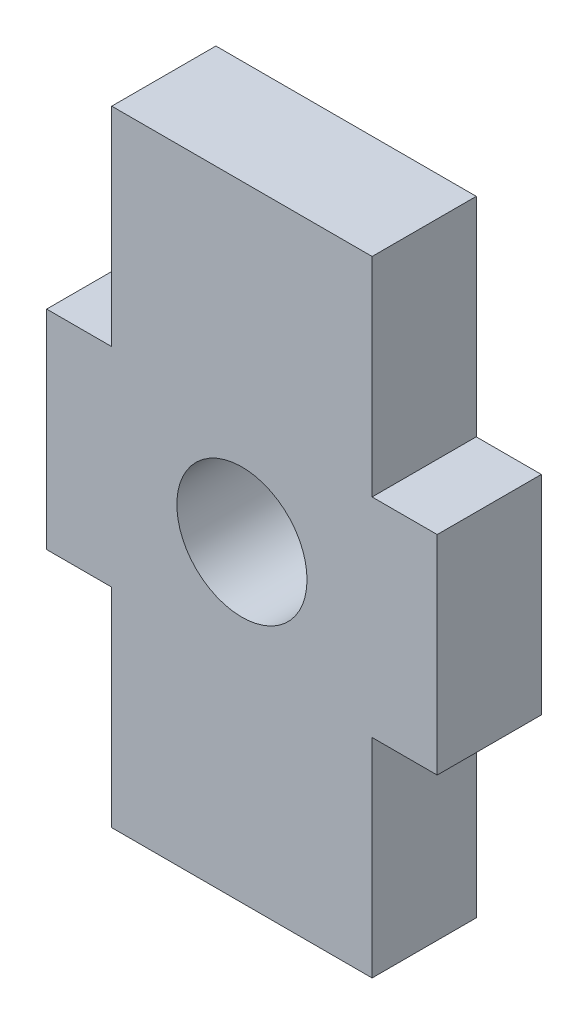
ISO-10303-21;
HEADER;
FILE_DESCRIPTION(('STEP AP214'),'2;1');
FILE_NAME('part.step','',(''),(''),'','','');
FILE_SCHEMA(('AUTOMOTIVE_DESIGN { 1 0 10303 214 1 1 1 1 }'));
ENDSEC;
DATA;
#1=APPLICATION_CONTEXT('core data for automotive mechanical design processes');
#2=APPLICATION_PROTOCOL_DEFINITION('international standard','automotive_design',2000,#1);
#3=PRODUCT_CONTEXT('',#1,'mechanical');
#4=PRODUCT('Part','Part','',(#3));
#5=PRODUCT_RELATED_PRODUCT_CATEGORY('part','',(#4));
#6=PRODUCT_DEFINITION_FORMATION('','',#4);
#7=PRODUCT_DEFINITION_CONTEXT('part definition',#1,'design');
#8=PRODUCT_DEFINITION('design','',#6,#7);
#9=PRODUCT_DEFINITION_SHAPE('','',#8);
#10=(LENGTH_UNIT() NAMED_UNIT(*) SI_UNIT(.MILLI.,.METRE.));
#11=(NAMED_UNIT(*) PLANE_ANGLE_UNIT() SI_UNIT($,.RADIAN.));
#12=(NAMED_UNIT(*) SI_UNIT($,.STERADIAN.) SOLID_ANGLE_UNIT());
#13=UNCERTAINTY_MEASURE_WITH_UNIT(LENGTH_MEASURE(1.E-05),#10,'distance_accuracy_value','');
#14=(GEOMETRIC_REPRESENTATION_CONTEXT(3) GLOBAL_UNCERTAINTY_ASSIGNED_CONTEXT((#13)) GLOBAL_UNIT_ASSIGNED_CONTEXT((#10,
#11,#12)) REPRESENTATION_CONTEXT('',''));
#15=CARTESIAN_POINT('',(0.,0.,0.));
#16=DIRECTION('',(0.,0.,1.));
#17=DIRECTION('',(1.,0.,0.));
#18=AXIS2_PLACEMENT_3D('',#15,#16,#17);
#19=CARTESIAN_POINT('',(0.,0.,2.));
#20=DIRECTION('',(0.,0.,-1.));
#21=DIRECTION('',(-1.,0.,0.));
#22=AXIS2_PLACEMENT_3D('',#19,#20,#21);
#23=PLANE('',#22);
#24=DIRECTION('',(0.,1.,0.));
#25=VECTOR('',#24,1.);
#26=CARTESIAN_POINT('',(1957.17680872112,1462.88411595094,2.));
#27=LINE('',#26,#25);
#28=CARTESIAN_POINT('',(1957.17680872112,1462.88411595094,2.));
#29=VERTEX_POINT('',#28);
#30=CARTESIAN_POINT('',(1957.17680872112,1466.88411595094,2.));
#31=VERTEX_POINT('',#30);
#32=EDGE_CURVE('E176',#29,#31,#27,.T.);
#33=ORIENTED_EDGE('',*,*,#32,.T.);
#34=DIRECTION('',(-1.,0.,0.));
#35=VECTOR('',#34,1.);
#36=CARTESIAN_POINT('',(1952.17680872112,1466.88411595094,2.));
#37=LINE('',#36,#35);
#38=CARTESIAN_POINT('',(1952.17680872112,1466.88411595094,2.));
#39=VERTEX_POINT('',#38);
#40=EDGE_CURVE('E104',#31,#39,#37,.T.);
#41=ORIENTED_EDGE('',*,*,#40,.T.);
#42=DIRECTION('',(0.,-1.,0.));
#43=VECTOR('',#42,1.);
#44=CARTESIAN_POINT('',(1952.17680872112,1462.88411595094,2.));
#45=LINE('',#44,#43);
#46=CARTESIAN_POINT('',(1952.17680872112,1462.88411595094,2.));
#47=VERTEX_POINT('',#46);
#48=EDGE_CURVE('E203',#39,#47,#45,.T.);
#49=ORIENTED_EDGE('',*,*,#48,.T.);
#50=DIRECTION('',(-1.,0.,0.));
#51=VECTOR('',#50,1.);
#52=CARTESIAN_POINT('',(1952.17680872112,1462.88411595094,2.));
#53=LINE('',#52,#51);
#54=CARTESIAN_POINT('',(1950.92680872112,1462.88411595094,2.));
#55=VERTEX_POINT('',#54);
#56=EDGE_CURVE('E222',#47,#55,#53,.T.);
#57=ORIENTED_EDGE('',*,*,#56,.T.);
#58=DIRECTION('',(0.,-1.,0.));
#59=VECTOR('',#58,1.);
#60=CARTESIAN_POINT('',(1950.92680872112,1462.88411595094,2.));
#61=LINE('',#60,#59);
#62=CARTESIAN_POINT('',(1950.92680872112,1458.88411595094,2.));
#63=VERTEX_POINT('',#62);
#64=EDGE_CURVE('E219',#55,#63,#61,.T.);
#65=ORIENTED_EDGE('',*,*,#64,.T.);
#66=DIRECTION('',(1.,0.,0.));
#67=VECTOR('',#66,1.);
#68=CARTESIAN_POINT('',(1952.17680872112,1458.88411595094,2.));
#69=LINE('',#68,#67);
#70=CARTESIAN_POINT('',(1952.17680872112,1458.88411595094,2.));
#71=VERTEX_POINT('',#70);
#72=EDGE_CURVE('E221',#63,#71,#69,.T.);
#73=ORIENTED_EDGE('',*,*,#72,.T.);
#74=DIRECTION('',(-2.22044604925031E-13,-1.,0.));
#75=VECTOR('',#74,1.);
#76=CARTESIAN_POINT('',(1952.17680872112,1458.88411595094,2.));
#77=LINE('',#76,#75);
#78=CARTESIAN_POINT('',(1952.17680872112,1454.88411595094,2.));
#79=VERTEX_POINT('',#78);
#80=EDGE_CURVE('E224',#71,#79,#77,.T.);
#81=ORIENTED_EDGE('',*,*,#80,.T.);
#82=DIRECTION('',(1.,0.,0.));
#83=VECTOR('',#82,1.);
#84=CARTESIAN_POINT('',(1952.17680872112,1454.88411595094,2.));
#85=LINE('',#84,#83);
#86=CARTESIAN_POINT('',(1957.17680872112,1454.88411595094,2.));
#87=VERTEX_POINT('',#86);
#88=EDGE_CURVE('E230',#79,#87,#85,.T.);
#89=ORIENTED_EDGE('',*,*,#88,.T.);
#90=DIRECTION('',(0.,1.,0.));
#91=VECTOR('',#90,1.);
#92=CARTESIAN_POINT('',(1957.17680872112,1458.88411595094,2.));
#93=LINE('',#92,#91);
#94=CARTESIAN_POINT('',(1957.17680872112,1458.88411595094,2.));
#95=VERTEX_POINT('',#94);
#96=EDGE_CURVE('E135',#87,#95,#93,.T.);
#97=ORIENTED_EDGE('',*,*,#96,.T.);
#98=DIRECTION('',(1.,0.,0.));
#99=VECTOR('',#98,1.);
#100=CARTESIAN_POINT('',(1957.17680872112,1458.88411595094,2.));
#101=LINE('',#100,#99);
#102=CARTESIAN_POINT('',(1958.42680872112,1458.88411595094,2.));
#103=VERTEX_POINT('',#102);
#104=EDGE_CURVE('E129',#95,#103,#101,.T.);
#105=ORIENTED_EDGE('',*,*,#104,.T.);
#106=DIRECTION('',(1.11022302462522E-13,1.,0.));
#107=VECTOR('',#106,1.);
#108=CARTESIAN_POINT('',(1958.42680872112,1462.88411595094,2.));
#109=LINE('',#108,#107);
#110=CARTESIAN_POINT('',(1958.42680872112,1462.88411595094,2.));
#111=VERTEX_POINT('',#110);
#112=EDGE_CURVE('E133',#103,#111,#109,.T.);
#113=ORIENTED_EDGE('',*,*,#112,.T.);
#114=DIRECTION('',(-1.,0.,0.));
#115=VECTOR('',#114,1.);
#116=CARTESIAN_POINT('',(1957.17680872112,1462.88411595094,2.));
#117=LINE('',#116,#115);
#118=EDGE_CURVE('E49',#111,#29,#117,.T.);
#119=ORIENTED_EDGE('',*,*,#118,.T.);
#120=EDGE_LOOP('',(#33,#41,#49,#57,#65,#73,#81,#89,#97,#105,#113,#119));
#121=FACE_BOUND('',#120,.T.);
#122=CARTESIAN_POINT('',(1954.67680872112,1460.88411595095,2.));
#123=DIRECTION('',(0.,0.,1.));
#124=DIRECTION('',(1.,0.,0.));
#125=AXIS2_PLACEMENT_3D('',#122,#123,#124);
#126=CIRCLE('',#125,1.24999999999997);
#127=CARTESIAN_POINT('',(1955.92680872112,1460.88411595095,2.));
#128=VERTEX_POINT('',#127);
#129=EDGE_CURVE('E157',#128,#128,#126,.T.);
#130=ORIENTED_EDGE('',*,*,#129,.F.);
#131=EDGE_LOOP('',(#130));
#132=FACE_BOUND('',#131,.T.);
#133=ADVANCED_FACE('F32',(#121,#132),#23,.F.);
#134=CARTESIAN_POINT('',(0.,0.,0.));
#135=DIRECTION('',(0.,0.,-1.));
#136=DIRECTION('',(-1.,0.,0.));
#137=AXIS2_PLACEMENT_3D('',#134,#135,#136);
#138=PLANE('',#137);
#139=DIRECTION('',(0.,1.,0.));
#140=VECTOR('',#139,1.);
#141=CARTESIAN_POINT('',(1957.17680872112,1462.88411595094,0.));
#142=LINE('',#141,#140);
#143=CARTESIAN_POINT('',(1957.17680872112,1462.88411595094,0.));
#144=VERTEX_POINT('',#143);
#145=CARTESIAN_POINT('',(1957.17680872112,1466.88411595094,0.));
#146=VERTEX_POINT('',#145);
#147=EDGE_CURVE('E153',#144,#146,#142,.T.);
#148=ORIENTED_EDGE('',*,*,#147,.F.);
#149=DIRECTION('',(-1.,0.,0.));
#150=VECTOR('',#149,1.);
#151=CARTESIAN_POINT('',(1957.17680872112,1462.88411595094,0.));
#152=LINE('',#151,#150);
#153=CARTESIAN_POINT('',(1958.42680872112,1462.88411595094,0.));
#154=VERTEX_POINT('',#153);
#155=EDGE_CURVE('E96',#154,#144,#152,.T.);
#156=ORIENTED_EDGE('',*,*,#155,.F.);
#157=DIRECTION('',(1.11022302462522E-13,1.,0.));
#158=VECTOR('',#157,1.);
#159=CARTESIAN_POINT('',(1958.42680872112,1462.88411595094,0.));
#160=LINE('',#159,#158);
#161=CARTESIAN_POINT('',(1958.42680872112,1458.88411595094,0.));
#162=VERTEX_POINT('',#161);
#163=EDGE_CURVE('E90',#162,#154,#160,.T.);
#164=ORIENTED_EDGE('',*,*,#163,.F.);
#165=DIRECTION('',(1.,0.,0.));
#166=VECTOR('',#165,1.);
#167=CARTESIAN_POINT('',(1957.17680872112,1458.88411595094,0.));
#168=LINE('',#167,#166);
#169=CARTESIAN_POINT('',(1957.17680872112,1458.88411595094,0.));
#170=VERTEX_POINT('',#169);
#171=EDGE_CURVE('E143',#170,#162,#168,.T.);
#172=ORIENTED_EDGE('',*,*,#171,.F.);
#173=DIRECTION('',(0.,1.,0.));
#174=VECTOR('',#173,1.);
#175=CARTESIAN_POINT('',(1957.17680872112,1458.88411595094,0.));
#176=LINE('',#175,#174);
#177=CARTESIAN_POINT('',(1957.17680872112,1454.88411595094,0.));
#178=VERTEX_POINT('',#177);
#179=EDGE_CURVE('E171',#178,#170,#176,.T.);
#180=ORIENTED_EDGE('',*,*,#179,.F.);
#181=DIRECTION('',(1.,0.,0.));
#182=VECTOR('',#181,1.);
#183=CARTESIAN_POINT('',(1952.17680872112,1454.88411595094,0.));
#184=LINE('',#183,#182);
#185=CARTESIAN_POINT('',(1952.17680872112,1454.88411595094,0.));
#186=VERTEX_POINT('',#185);
#187=EDGE_CURVE('E169',#186,#178,#184,.T.);
#188=ORIENTED_EDGE('',*,*,#187,.F.);
#189=DIRECTION('',(-2.22044604925031E-13,-1.,0.));
#190=VECTOR('',#189,1.);
#191=CARTESIAN_POINT('',(1952.17680872112,1458.88411595094,0.));
#192=LINE('',#191,#190);
#193=CARTESIAN_POINT('',(1952.17680872112,1458.88411595094,0.));
#194=VERTEX_POINT('',#193);
#195=EDGE_CURVE('E167',#194,#186,#192,.T.);
#196=ORIENTED_EDGE('',*,*,#195,.F.);
#197=DIRECTION('',(1.,0.,0.));
#198=VECTOR('',#197,1.);
#199=CARTESIAN_POINT('',(1952.17680872112,1458.88411595094,0.));
#200=LINE('',#199,#198);
#201=CARTESIAN_POINT('',(1950.92680872112,1458.88411595094,0.));
#202=VERTEX_POINT('',#201);
#203=EDGE_CURVE('E165',#202,#194,#200,.T.);
#204=ORIENTED_EDGE('',*,*,#203,.F.);
#205=DIRECTION('',(0.,-1.,0.));
#206=VECTOR('',#205,1.);
#207=CARTESIAN_POINT('',(1950.92680872112,1462.88411595094,0.));
#208=LINE('',#207,#206);
#209=CARTESIAN_POINT('',(1950.92680872112,1462.88411595094,0.));
#210=VERTEX_POINT('',#209);
#211=EDGE_CURVE('E163',#210,#202,#208,.T.);
#212=ORIENTED_EDGE('',*,*,#211,.F.);
#213=DIRECTION('',(-1.,0.,0.));
#214=VECTOR('',#213,1.);
#215=CARTESIAN_POINT('',(1952.17680872112,1462.88411595094,0.));
#216=LINE('',#215,#214);
#217=CARTESIAN_POINT('',(1952.17680872112,1462.88411595094,0.));
#218=VERTEX_POINT('',#217);
#219=EDGE_CURVE('E161',#218,#210,#216,.T.);
#220=ORIENTED_EDGE('',*,*,#219,.F.);
#221=DIRECTION('',(0.,-1.,0.));
#222=VECTOR('',#221,1.);
#223=CARTESIAN_POINT('',(1952.17680872112,1462.88411595094,0.));
#224=LINE('',#223,#222);
#225=CARTESIAN_POINT('',(1952.17680872112,1466.88411595094,0.));
#226=VERTEX_POINT('',#225);
#227=EDGE_CURVE('E159',#226,#218,#224,.T.);
#228=ORIENTED_EDGE('',*,*,#227,.F.);
#229=DIRECTION('',(-1.,0.,0.));
#230=VECTOR('',#229,1.);
#231=CARTESIAN_POINT('',(1952.17680872112,1466.88411595094,0.));
#232=LINE('',#231,#230);
#233=EDGE_CURVE('E156',#146,#226,#232,.T.);
#234=ORIENTED_EDGE('',*,*,#233,.F.);
#235=EDGE_LOOP('',(#148,#156,#164,#172,#180,#188,#196,#204,#212,#220,#228,#234));
#236=FACE_BOUND('',#235,.T.);
#237=CARTESIAN_POINT('',(1954.67680872112,1460.88411595095,0.));
#238=DIRECTION('',(0.,0.,1.));
#239=DIRECTION('',(1.,0.,0.));
#240=AXIS2_PLACEMENT_3D('',#237,#238,#239);
#241=CIRCLE('',#240,1.24999999999997);
#242=CARTESIAN_POINT('',(1955.92680872112,1460.88411595095,0.));
#243=VERTEX_POINT('',#242);
#244=EDGE_CURVE('E377',#243,#243,#241,.T.);
#245=ORIENTED_EDGE('',*,*,#244,.T.);
#246=EDGE_LOOP('',(#245));
#247=FACE_BOUND('',#246,.T.);
#248=ADVANCED_FACE('F207',(#236,#247),#138,.T.);
#249=CARTESIAN_POINT('',(1957.17680872112,1462.88411595094,2.));
#250=DIRECTION('',(-1.,0.,0.));
#251=DIRECTION('',(0.,0.,1.));
#252=AXIS2_PLACEMENT_3D('',#249,#250,#251);
#253=PLANE('',#252);
#254=ORIENTED_EDGE('',*,*,#147,.T.);
#255=DIRECTION('',(0.,0.,-1.));
#256=VECTOR('',#255,1.);
#257=CARTESIAN_POINT('',(1957.17680872112,1466.88411595094,2.));
#258=LINE('',#257,#256);
#259=EDGE_CURVE('E11',#31,#146,#258,.T.);
#260=ORIENTED_EDGE('',*,*,#259,.F.);
#261=ORIENTED_EDGE('',*,*,#32,.F.);
#262=DIRECTION('',(0.,0.,-1.));
#263=VECTOR('',#262,1.);
#264=CARTESIAN_POINT('',(1957.17680872112,1462.88411595094,2.));
#265=LINE('',#264,#263);
#266=EDGE_CURVE('E149',#29,#144,#265,.T.);
#267=ORIENTED_EDGE('',*,*,#266,.T.);
#268=EDGE_LOOP('',(#254,#260,#261,#267));
#269=FACE_BOUND('',#268,.T.);
#270=ADVANCED_FACE('F34',(#269),#253,.F.);
#271=CARTESIAN_POINT('',(1952.17680872112,1466.88411595094,2.));
#272=DIRECTION('',(0.,-1.,0.));
#273=DIRECTION('',(0.,0.,-1.));
#274=AXIS2_PLACEMENT_3D('',#271,#272,#273);
#275=PLANE('',#274);
#276=ORIENTED_EDGE('',*,*,#233,.T.);
#277=DIRECTION('',(0.,0.,-1.));
#278=VECTOR('',#277,1.);
#279=CARTESIAN_POINT('',(1952.17680872112,1466.88411595094,2.));
#280=LINE('',#279,#278);
#281=EDGE_CURVE('E41',#39,#226,#280,.T.);
#282=ORIENTED_EDGE('',*,*,#281,.F.);
#283=ORIENTED_EDGE('',*,*,#40,.F.);
#284=ORIENTED_EDGE('',*,*,#259,.T.);
#285=EDGE_LOOP('',(#276,#282,#283,#284));
#286=FACE_BOUND('',#285,.T.);
#287=ADVANCED_FACE('F264',(#286),#275,.F.);
#288=CARTESIAN_POINT('',(1952.17680872112,1462.88411595094,2.));
#289=DIRECTION('',(1.,0.,0.));
#290=DIRECTION('',(0.,0.,-1.));
#291=AXIS2_PLACEMENT_3D('',#288,#289,#290);
#292=PLANE('',#291);
#293=ORIENTED_EDGE('',*,*,#227,.T.);
#294=DIRECTION('',(0.,0.,-1.));
#295=VECTOR('',#294,1.);
#296=CARTESIAN_POINT('',(1952.17680872112,1462.88411595094,2.));
#297=LINE('',#296,#295);
#298=EDGE_CURVE('E195',#47,#218,#297,.T.);
#299=ORIENTED_EDGE('',*,*,#298,.F.);
#300=ORIENTED_EDGE('',*,*,#48,.F.);
#301=ORIENTED_EDGE('',*,*,#281,.T.);
#302=EDGE_LOOP('',(#293,#299,#300,#301));
#303=FACE_BOUND('',#302,.T.);
#304=ADVANCED_FACE('F201',(#303),#292,.F.);
#305=CARTESIAN_POINT('',(1952.17680872112,1462.88411595094,2.));
#306=DIRECTION('',(0.,-1.,0.));
#307=DIRECTION('',(0.,0.,-1.));
#308=AXIS2_PLACEMENT_3D('',#305,#306,#307);
#309=PLANE('',#308);
#310=ORIENTED_EDGE('',*,*,#219,.T.);
#311=DIRECTION('',(0.,0.,-1.));
#312=VECTOR('',#311,1.);
#313=CARTESIAN_POINT('',(1950.92680872112,1462.88411595094,2.));
#314=LINE('',#313,#312);
#315=EDGE_CURVE('E192',#55,#210,#314,.T.);
#316=ORIENTED_EDGE('',*,*,#315,.F.);
#317=ORIENTED_EDGE('',*,*,#56,.F.);
#318=ORIENTED_EDGE('',*,*,#298,.T.);
#319=EDGE_LOOP('',(#310,#316,#317,#318));
#320=FACE_BOUND('',#319,.T.);
#321=ADVANCED_FACE('F213',(#320),#309,.F.);
#322=CARTESIAN_POINT('',(1950.92680872112,1462.88411595094,2.));
#323=DIRECTION('',(1.,0.,0.));
#324=DIRECTION('',(0.,0.,-1.));
#325=AXIS2_PLACEMENT_3D('',#322,#323,#324);
#326=PLANE('',#325);
#327=ORIENTED_EDGE('',*,*,#211,.T.);
#328=DIRECTION('',(0.,0.,-1.));
#329=VECTOR('',#328,1.);
#330=CARTESIAN_POINT('',(1950.92680872112,1458.88411595094,2.));
#331=LINE('',#330,#329);
#332=EDGE_CURVE('E189',#63,#202,#331,.T.);
#333=ORIENTED_EDGE('',*,*,#332,.F.);
#334=ORIENTED_EDGE('',*,*,#64,.F.);
#335=ORIENTED_EDGE('',*,*,#315,.T.);
#336=EDGE_LOOP('',(#327,#333,#334,#335));
#337=FACE_BOUND('',#336,.T.);
#338=ADVANCED_FACE('F217',(#337),#326,.F.);
#339=CARTESIAN_POINT('',(1952.17680872112,1458.88411595094,2.));
#340=DIRECTION('',(0.,1.,0.));
#341=DIRECTION('',(0.,0.,1.));
#342=AXIS2_PLACEMENT_3D('',#339,#340,#341);
#343=PLANE('',#342);
#344=ORIENTED_EDGE('',*,*,#203,.T.);
#345=DIRECTION('',(0.,0.,-1.));
#346=VECTOR('',#345,1.);
#347=CARTESIAN_POINT('',(1952.17680872112,1458.88411595094,2.));
#348=LINE('',#347,#346);
#349=EDGE_CURVE('E186',#71,#194,#348,.T.);
#350=ORIENTED_EDGE('',*,*,#349,.F.);
#351=ORIENTED_EDGE('',*,*,#72,.F.);
#352=ORIENTED_EDGE('',*,*,#332,.T.);
#353=EDGE_LOOP('',(#344,#350,#351,#352));
#354=FACE_BOUND('',#353,.T.);
#355=ADVANCED_FACE('F277',(#354),#343,.F.);
#356=CARTESIAN_POINT('',(1952.17680872112,1458.88411595094,2.));
#357=DIRECTION('',(1.,-2.22044604925031E-13,0.));
#358=DIRECTION('',(2.22044604925031E-13,1.,0.));
#359=AXIS2_PLACEMENT_3D('',#356,#357,#358);
#360=PLANE('',#359);
#361=ORIENTED_EDGE('',*,*,#195,.T.);
#362=DIRECTION('',(0.,0.,-1.));
#363=VECTOR('',#362,1.);
#364=CARTESIAN_POINT('',(1952.17680872112,1454.88411595094,2.));
#365=LINE('',#364,#363);
#366=EDGE_CURVE('E183',#79,#186,#365,.T.);
#367=ORIENTED_EDGE('',*,*,#366,.F.);
#368=ORIENTED_EDGE('',*,*,#80,.F.);
#369=ORIENTED_EDGE('',*,*,#349,.T.);
#370=EDGE_LOOP('',(#361,#367,#368,#369));
#371=FACE_BOUND('',#370,.T.);
#372=ADVANCED_FACE('F280',(#371),#360,.F.);
#373=CARTESIAN_POINT('',(1952.17680872112,1454.88411595094,2.));
#374=DIRECTION('',(0.,1.,0.));
#375=DIRECTION('',(0.,0.,1.));
#376=AXIS2_PLACEMENT_3D('',#373,#374,#375);
#377=PLANE('',#376);
#378=ORIENTED_EDGE('',*,*,#187,.T.);
#379=DIRECTION('',(0.,0.,-1.));
#380=VECTOR('',#379,1.);
#381=CARTESIAN_POINT('',(1957.17680872112,1454.88411595094,2.));
#382=LINE('',#381,#380);
#383=EDGE_CURVE('E180',#87,#178,#382,.T.);
#384=ORIENTED_EDGE('',*,*,#383,.F.);
#385=ORIENTED_EDGE('',*,*,#88,.F.);
#386=ORIENTED_EDGE('',*,*,#366,.T.);
#387=EDGE_LOOP('',(#378,#384,#385,#386));
#388=FACE_BOUND('',#387,.T.);
#389=ADVANCED_FACE('F236',(#388),#377,.F.);
#390=CARTESIAN_POINT('',(1957.17680872112,1458.88411595094,2.));
#391=DIRECTION('',(-1.,0.,0.));
#392=DIRECTION('',(0.,0.,1.));
#393=AXIS2_PLACEMENT_3D('',#390,#391,#392);
#394=PLANE('',#393);
#395=ORIENTED_EDGE('',*,*,#179,.T.);
#396=DIRECTION('',(0.,0.,-1.));
#397=VECTOR('',#396,1.);
#398=CARTESIAN_POINT('',(1957.17680872112,1458.88411595094,2.));
#399=LINE('',#398,#397);
#400=EDGE_CURVE('E144',#95,#170,#399,.T.);
#401=ORIENTED_EDGE('',*,*,#400,.F.);
#402=ORIENTED_EDGE('',*,*,#96,.F.);
#403=ORIENTED_EDGE('',*,*,#383,.T.);
#404=EDGE_LOOP('',(#395,#401,#402,#403));
#405=FACE_BOUND('',#404,.T.);
#406=ADVANCED_FACE('F240',(#405),#394,.F.);
#407=CARTESIAN_POINT('',(1957.17680872112,1458.88411595094,2.));
#408=DIRECTION('',(0.,1.,0.));
#409=DIRECTION('',(0.,0.,1.));
#410=AXIS2_PLACEMENT_3D('',#407,#408,#409);
#411=PLANE('',#410);
#412=ORIENTED_EDGE('',*,*,#171,.T.);
#413=DIRECTION('',(0.,0.,-1.));
#414=VECTOR('',#413,1.);
#415=CARTESIAN_POINT('',(1958.42680872112,1458.88411595094,2.));
#416=LINE('',#415,#414);
#417=EDGE_CURVE('E140',#103,#162,#416,.T.);
#418=ORIENTED_EDGE('',*,*,#417,.F.);
#419=ORIENTED_EDGE('',*,*,#104,.F.);
#420=ORIENTED_EDGE('',*,*,#400,.T.);
#421=EDGE_LOOP('',(#412,#418,#419,#420));
#422=FACE_BOUND('',#421,.T.);
#423=ADVANCED_FACE('F141',(#422),#411,.F.);
#424=CARTESIAN_POINT('',(1958.42680872112,1462.88411595094,2.));
#425=DIRECTION('',(-1.,1.11022302462522E-13,0.));
#426=DIRECTION('',(-1.11022302462522E-13,-1.,0.));
#427=AXIS2_PLACEMENT_3D('',#424,#425,#426);
#428=PLANE('',#427);
#429=ORIENTED_EDGE('',*,*,#163,.T.);
#430=DIRECTION('',(0.,0.,-1.));
#431=VECTOR('',#430,1.);
#432=CARTESIAN_POINT('',(1958.42680872112,1462.88411595094,2.));
#433=LINE('',#432,#431);
#434=EDGE_CURVE('E145',#111,#154,#433,.T.);
#435=ORIENTED_EDGE('',*,*,#434,.F.);
#436=ORIENTED_EDGE('',*,*,#112,.F.);
#437=ORIENTED_EDGE('',*,*,#417,.T.);
#438=EDGE_LOOP('',(#429,#435,#436,#437));
#439=FACE_BOUND('',#438,.T.);
#440=ADVANCED_FACE('F147',(#439),#428,.F.);
#441=CARTESIAN_POINT('',(1957.17680872112,1462.88411595094,2.));
#442=DIRECTION('',(0.,-1.,0.));
#443=DIRECTION('',(0.,0.,-1.));
#444=AXIS2_PLACEMENT_3D('',#441,#442,#443);
#445=PLANE('',#444);
#446=ORIENTED_EDGE('',*,*,#155,.T.);
#447=ORIENTED_EDGE('',*,*,#266,.F.);
#448=ORIENTED_EDGE('',*,*,#118,.F.);
#449=ORIENTED_EDGE('',*,*,#434,.T.);
#450=EDGE_LOOP('',(#446,#447,#448,#449));
#451=FACE_BOUND('',#450,.T.);
#452=ADVANCED_FACE('F244',(#451),#445,.F.);
#453=CARTESIAN_POINT('',(1954.67680872112,1460.88411595095,2.));
#454=DIRECTION('',(0.,0.,-1.));
#455=DIRECTION('',(-1.,0.,0.));
#456=AXIS2_PLACEMENT_3D('',#453,#454,#455);
#457=CYLINDRICAL_SURFACE('',#456,1.24999999999997);
#458=ORIENTED_EDGE('',*,*,#129,.T.);
#459=EDGE_LOOP('',(#458));
#460=FACE_BOUND('',#459,.T.);
#461=ORIENTED_EDGE('',*,*,#244,.F.);
#462=EDGE_LOOP('',(#461));
#463=FACE_BOUND('',#462,.T.);
#464=ADVANCED_FACE('F246',(#460,#463),#457,.F.);
#465=CLOSED_SHELL('',(#133,#248,#270,#287,#304,#321,#338,#355,#372,#389,#406,#423,#440,#452,#464));
#466=MANIFOLD_SOLID_BREP('B2',#465);
#467=ADVANCED_BREP_SHAPE_REPRESENTATION('',(#18,#466),#14);
#468=SHAPE_DEFINITION_REPRESENTATION(#9,#467);
ENDSEC;
END-ISO-10303-21;
